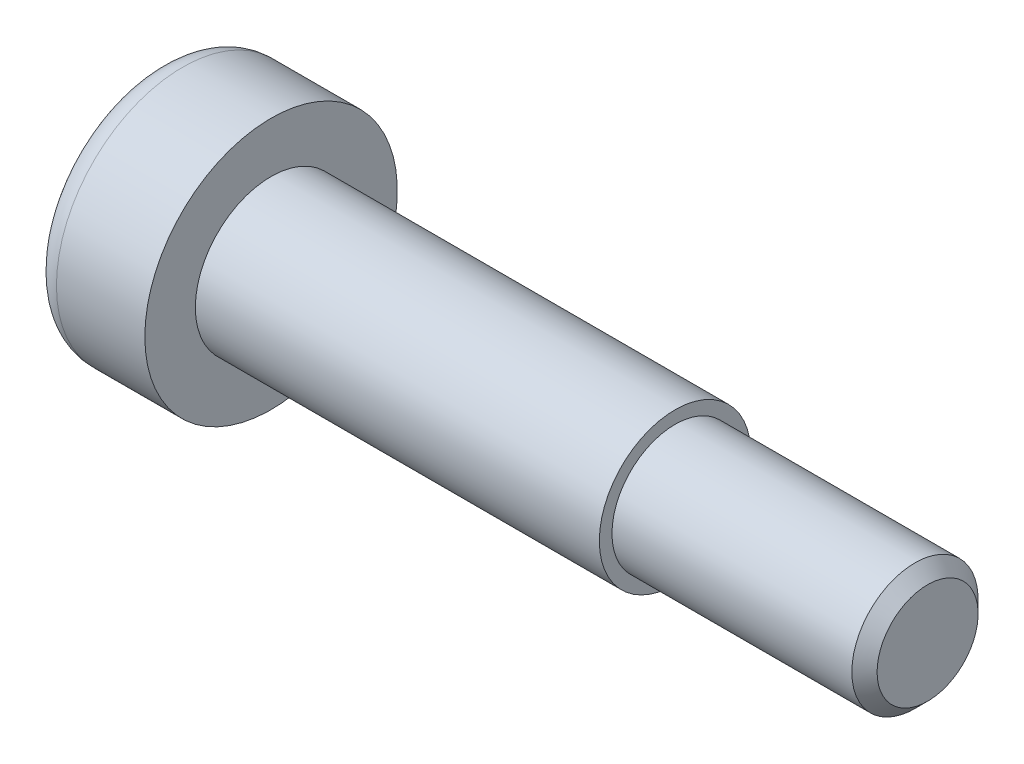
ISO-10303-21;
HEADER;
FILE_DESCRIPTION(('STEP AP214'),'2;1');
FILE_NAME('part.step','',(''),(''),'','','');
FILE_SCHEMA(('AUTOMOTIVE_DESIGN { 1 0 10303 214 1 1 1 1 }'));
ENDSEC;
DATA;
#1=APPLICATION_CONTEXT('core data for automotive mechanical design processes');
#2=APPLICATION_PROTOCOL_DEFINITION('international standard','automotive_design',2000,#1);
#3=PRODUCT_CONTEXT('',#1,'mechanical');
#4=PRODUCT('Part','Part','',(#3));
#5=PRODUCT_RELATED_PRODUCT_CATEGORY('part','',(#4));
#6=PRODUCT_DEFINITION_FORMATION('','',#4);
#7=PRODUCT_DEFINITION_CONTEXT('part definition',#1,'design');
#8=PRODUCT_DEFINITION('design','',#6,#7);
#9=PRODUCT_DEFINITION_SHAPE('','',#8);
#10=(LENGTH_UNIT() NAMED_UNIT(*) SI_UNIT(.MILLI.,.METRE.));
#11=(NAMED_UNIT(*) PLANE_ANGLE_UNIT() SI_UNIT($,.RADIAN.));
#12=(NAMED_UNIT(*) SI_UNIT($,.STERADIAN.) SOLID_ANGLE_UNIT());
#13=UNCERTAINTY_MEASURE_WITH_UNIT(LENGTH_MEASURE(1.E-05),#10,'distance_accuracy_value','');
#14=(GEOMETRIC_REPRESENTATION_CONTEXT(3) GLOBAL_UNCERTAINTY_ASSIGNED_CONTEXT((#13)) GLOBAL_UNIT_ASSIGNED_CONTEXT((#10,
#11,#12)) REPRESENTATION_CONTEXT('',''));
#15=CARTESIAN_POINT('',(0.,0.,0.));
#16=DIRECTION('',(0.,0.,1.));
#17=DIRECTION('',(1.,0.,0.));
#18=AXIS2_PLACEMENT_3D('',#15,#16,#17);
#19=CARTESIAN_POINT('',(0.,0.,0.));
#20=DIRECTION('',(1.,0.,0.));
#21=DIRECTION('',(0.,0.,-1.));
#22=AXIS2_PLACEMENT_3D('',#19,#20,#21);
#23=PLANE('',#22);
#24=CARTESIAN_POINT('',(0.,0.,0.));
#25=DIRECTION('',(1.,0.,0.));
#26=DIRECTION('',(0.,0.,-1.));
#27=AXIS2_PLACEMENT_3D('',#24,#25,#26);
#28=CIRCLE('',#27,4.);
#29=CARTESIAN_POINT('',(0.,0.,-4.));
#30=VERTEX_POINT('',#29);
#31=EDGE_CURVE('E157',#30,#30,#28,.F.);
#32=ORIENTED_EDGE('',*,*,#31,.T.);
#33=EDGE_LOOP('',(#32));
#34=FACE_BOUND('',#33,.T.);
#35=DIRECTION('',(0.,-0.5,-0.866025403784439));
#36=VECTOR('',#35,1.);
#37=CARTESIAN_POINT('',(0.,1.73205080756888,0.));
#38=LINE('',#37,#36);
#39=CARTESIAN_POINT('',(0.,1.73205080756888,0.));
#40=VERTEX_POINT('',#39);
#41=CARTESIAN_POINT('',(0.,0.866025403784439,-1.5));
#42=VERTEX_POINT('',#41);
#43=EDGE_CURVE('E127',#40,#42,#38,.T.);
#44=ORIENTED_EDGE('',*,*,#43,.F.);
#45=DIRECTION('',(0.,0.5,-0.866025403784439));
#46=VECTOR('',#45,1.);
#47=CARTESIAN_POINT('',(0.,0.86602540378444,1.5));
#48=LINE('',#47,#46);
#49=CARTESIAN_POINT('',(0.,0.86602540378444,1.5));
#50=VERTEX_POINT('',#49);
#51=EDGE_CURVE('E53',#50,#40,#48,.T.);
#52=ORIENTED_EDGE('',*,*,#51,.F.);
#53=DIRECTION('',(0.,1.,0.));
#54=VECTOR('',#53,1.);
#55=CARTESIAN_POINT('',(0.,-0.866025403784439,1.5));
#56=LINE('',#55,#54);
#57=CARTESIAN_POINT('',(0.,-0.866025403784439,1.5));
#58=VERTEX_POINT('',#57);
#59=EDGE_CURVE('E136',#58,#50,#56,.T.);
#60=ORIENTED_EDGE('',*,*,#59,.F.);
#61=DIRECTION('',(0.,0.5,0.866025403784439));
#62=VECTOR('',#61,1.);
#63=CARTESIAN_POINT('',(0.,-1.73205080756888,0.));
#64=LINE('',#63,#62);
#65=CARTESIAN_POINT('',(0.,-1.73205080756888,0.));
#66=VERTEX_POINT('',#65);
#67=EDGE_CURVE('E134',#66,#58,#64,.T.);
#68=ORIENTED_EDGE('',*,*,#67,.F.);
#69=DIRECTION('',(0.,-0.5,0.866025403784439));
#70=VECTOR('',#69,1.);
#71=CARTESIAN_POINT('',(0.,-0.866025403784439,-1.5));
#72=LINE('',#71,#70);
#73=CARTESIAN_POINT('',(0.,-0.866025403784439,-1.5));
#74=VERTEX_POINT('',#73);
#75=EDGE_CURVE('E101',#74,#66,#72,.T.);
#76=ORIENTED_EDGE('',*,*,#75,.F.);
#77=DIRECTION('',(0.,-1.,0.));
#78=VECTOR('',#77,1.);
#79=CARTESIAN_POINT('',(0.,0.866025403784439,-1.5));
#80=LINE('',#79,#78);
#81=EDGE_CURVE('E130',#42,#74,#80,.T.);
#82=ORIENTED_EDGE('',*,*,#81,.F.);
#83=EDGE_LOOP('',(#44,#52,#60,#68,#76,#82));
#84=FACE_BOUND('',#83,.T.);
#85=ADVANCED_FACE('F38',(#34,#84),#23,.F.);
#86=CARTESIAN_POINT('',(0.,0.,0.));
#87=DIRECTION('',(-1.,0.,0.));
#88=DIRECTION('',(0.,0.,1.));
#89=AXIS2_PLACEMENT_3D('',#86,#87,#88);
#90=CYLINDRICAL_SURFACE('',#89,5.);
#91=CARTESIAN_POINT('',(1.,0.,0.));
#92=DIRECTION('',(1.,0.,0.));
#93=DIRECTION('',(0.,0.,-1.));
#94=AXIS2_PLACEMENT_3D('',#91,#92,#93);
#95=CIRCLE('',#94,5.);
#96=CARTESIAN_POINT('',(1.,0.,-5.));
#97=VERTEX_POINT('',#96);
#98=EDGE_CURVE('E160',#97,#97,#95,.T.);
#99=ORIENTED_EDGE('',*,*,#98,.T.);
#100=EDGE_LOOP('',(#99));
#101=FACE_BOUND('',#100,.T.);
#102=CARTESIAN_POINT('',(4.5,0.,0.));
#103=DIRECTION('',(-1.,0.,0.));
#104=DIRECTION('',(0.,0.,1.));
#105=AXIS2_PLACEMENT_3D('',#102,#103,#104);
#106=CIRCLE('',#105,5.);
#107=CARTESIAN_POINT('',(4.5,0.,5.));
#108=VERTEX_POINT('',#107);
#109=EDGE_CURVE('E154',#108,#108,#106,.T.);
#110=ORIENTED_EDGE('',*,*,#109,.T.);
#111=EDGE_LOOP('',(#110));
#112=FACE_BOUND('',#111,.T.);
#113=ADVANCED_FACE('F177',(#101,#112),#90,.T.);
#114=CARTESIAN_POINT('',(4.5,5.,0.));
#115=DIRECTION('',(-1.,0.,0.));
#116=DIRECTION('',(0.,0.,1.));
#117=AXIS2_PLACEMENT_3D('',#114,#115,#116);
#118=PLANE('',#117);
#119=ORIENTED_EDGE('',*,*,#109,.F.);
#120=EDGE_LOOP('',(#119));
#121=FACE_BOUND('',#120,.T.);
#122=CARTESIAN_POINT('',(4.5,0.,0.));
#123=DIRECTION('',(-1.,0.,0.));
#124=DIRECTION('',(0.,0.,1.));
#125=AXIS2_PLACEMENT_3D('',#122,#123,#124);
#126=CIRCLE('',#125,3.);
#127=CARTESIAN_POINT('',(4.5,0.,3.));
#128=VERTEX_POINT('',#127);
#129=EDGE_CURVE('E151',#128,#128,#126,.T.);
#130=ORIENTED_EDGE('',*,*,#129,.T.);
#131=EDGE_LOOP('',(#130));
#132=FACE_BOUND('',#131,.T.);
#133=ADVANCED_FACE('F183',(#121,#132),#118,.F.);
#134=CARTESIAN_POINT('',(0.,0.,0.));
#135=DIRECTION('',(-1.,0.,0.));
#136=DIRECTION('',(0.,0.,1.));
#137=AXIS2_PLACEMENT_3D('',#134,#135,#136);
#138=CYLINDRICAL_SURFACE('',#137,3.);
#139=ORIENTED_EDGE('',*,*,#129,.F.);
#140=EDGE_LOOP('',(#139));
#141=FACE_BOUND('',#140,.T.);
#142=CARTESIAN_POINT('',(20.5,0.,0.));
#143=DIRECTION('',(-1.,0.,0.));
#144=DIRECTION('',(0.,0.,1.));
#145=AXIS2_PLACEMENT_3D('',#142,#143,#144);
#146=CIRCLE('',#145,3.);
#147=CARTESIAN_POINT('',(20.5,0.,3.));
#148=VERTEX_POINT('',#147);
#149=EDGE_CURVE('E148',#148,#148,#146,.T.);
#150=ORIENTED_EDGE('',*,*,#149,.T.);
#151=EDGE_LOOP('',(#150));
#152=FACE_BOUND('',#151,.T.);
#153=ADVANCED_FACE('F190',(#141,#152),#138,.T.);
#154=CARTESIAN_POINT('',(20.5,3.,0.));
#155=DIRECTION('',(-1.,0.,0.));
#156=DIRECTION('',(0.,0.,1.));
#157=AXIS2_PLACEMENT_3D('',#154,#155,#156);
#158=PLANE('',#157);
#159=ORIENTED_EDGE('',*,*,#149,.F.);
#160=EDGE_LOOP('',(#159));
#161=FACE_BOUND('',#160,.T.);
#162=CARTESIAN_POINT('',(20.5,0.,0.));
#163=DIRECTION('',(-1.,0.,0.));
#164=DIRECTION('',(0.,0.,1.));
#165=AXIS2_PLACEMENT_3D('',#162,#163,#164);
#166=CIRCLE('',#165,2.5);
#167=CARTESIAN_POINT('',(20.5,0.,2.5));
#168=VERTEX_POINT('',#167);
#169=EDGE_CURVE('E140',#168,#168,#166,.T.);
#170=ORIENTED_EDGE('',*,*,#169,.T.);
#171=EDGE_LOOP('',(#170));
#172=FACE_BOUND('',#171,.T.);
#173=ADVANCED_FACE('F194',(#161,#172),#158,.F.);
#174=CARTESIAN_POINT('',(0.,0.,0.));
#175=DIRECTION('',(-1.,0.,0.));
#176=DIRECTION('',(0.,0.,1.));
#177=AXIS2_PLACEMENT_3D('',#174,#175,#176);
#178=CYLINDRICAL_SURFACE('',#177,2.5);
#179=CARTESIAN_POINT('',(30.,0.,0.));
#180=DIRECTION('',(-1.,0.,0.));
#181=DIRECTION('',(0.,0.,1.));
#182=AXIS2_PLACEMENT_3D('',#179,#180,#181);
#183=CIRCLE('',#182,2.5);
#184=CARTESIAN_POINT('',(30.,0.,2.5));
#185=VERTEX_POINT('',#184);
#186=EDGE_CURVE('E46',#185,#185,#183,.T.);
#187=ORIENTED_EDGE('',*,*,#186,.T.);
#188=EDGE_LOOP('',(#187));
#189=FACE_BOUND('',#188,.T.);
#190=ORIENTED_EDGE('',*,*,#169,.F.);
#191=EDGE_LOOP('',(#190));
#192=FACE_BOUND('',#191,.T.);
#193=ADVANCED_FACE('F165',(#189,#192),#178,.T.);
#194=CARTESIAN_POINT('',(30.5,2.5,0.));
#195=DIRECTION('',(-1.,0.,0.));
#196=DIRECTION('',(0.,0.,1.));
#197=AXIS2_PLACEMENT_3D('',#194,#195,#196);
#198=PLANE('',#197);
#199=CARTESIAN_POINT('',(30.5,0.,0.));
#200=DIRECTION('',(-1.,0.,0.));
#201=DIRECTION('',(0.,0.,1.));
#202=AXIS2_PLACEMENT_3D('',#199,#200,#201);
#203=CIRCLE('',#202,1.99999999999999);
#204=CARTESIAN_POINT('',(30.5,0.,1.99999999999999));
#205=VERTEX_POINT('',#204);
#206=EDGE_CURVE('E11',#205,#205,#203,.F.);
#207=ORIENTED_EDGE('',*,*,#206,.T.);
#208=EDGE_LOOP('',(#207));
#209=FACE_BOUND('',#208,.T.);
#210=ADVANCED_FACE('F201',(#209),#198,.F.);
#211=CARTESIAN_POINT('',(3.,0.86602540378444,1.5));
#212=DIRECTION('',(0.,0.866025403784439,0.5));
#213=DIRECTION('',(0.,-0.5,0.866025403784439));
#214=AXIS2_PLACEMENT_3D('',#211,#212,#213);
#215=PLANE('',#214);
#216=ORIENTED_EDGE('',*,*,#51,.T.);
#217=DIRECTION('',(-1.,0.,0.));
#218=VECTOR('',#217,1.);
#219=CARTESIAN_POINT('',(3.,1.73205080756888,0.));
#220=LINE('',#219,#218);
#221=CARTESIAN_POINT('',(3.,1.73205080756888,0.));
#222=VERTEX_POINT('',#221);
#223=EDGE_CURVE('E83',#222,#40,#220,.T.);
#224=ORIENTED_EDGE('',*,*,#223,.F.);
#225=DIRECTION('',(0.,0.5,-0.866025403784439));
#226=VECTOR('',#225,1.);
#227=CARTESIAN_POINT('',(3.,0.86602540378444,1.5));
#228=LINE('',#227,#226);
#229=CARTESIAN_POINT('',(3.,0.86602540378444,1.5));
#230=VERTEX_POINT('',#229);
#231=EDGE_CURVE('E138',#230,#222,#228,.T.);
#232=ORIENTED_EDGE('',*,*,#231,.F.);
#233=DIRECTION('',(-1.,0.,0.));
#234=VECTOR('',#233,1.);
#235=CARTESIAN_POINT('',(3.,0.86602540378444,1.5));
#236=LINE('',#235,#234);
#237=EDGE_CURVE('E61',#230,#50,#236,.T.);
#238=ORIENTED_EDGE('',*,*,#237,.T.);
#239=EDGE_LOOP('',(#216,#224,#232,#238));
#240=FACE_BOUND('',#239,.T.);
#241=ADVANCED_FACE('F204',(#240),#215,.F.);
#242=CARTESIAN_POINT('',(3.,-0.866025403784439,1.5));
#243=DIRECTION('',(0.,0.,1.));
#244=DIRECTION('',(1.,0.,0.));
#245=AXIS2_PLACEMENT_3D('',#242,#243,#244);
#246=PLANE('',#245);
#247=ORIENTED_EDGE('',*,*,#59,.T.);
#248=ORIENTED_EDGE('',*,*,#237,.F.);
#249=DIRECTION('',(0.,1.,0.));
#250=VECTOR('',#249,1.);
#251=CARTESIAN_POINT('',(3.,-0.866025403784439,1.5));
#252=LINE('',#251,#250);
#253=CARTESIAN_POINT('',(3.,-0.866025403784439,1.5));
#254=VERTEX_POINT('',#253);
#255=EDGE_CURVE('E113',#254,#230,#252,.T.);
#256=ORIENTED_EDGE('',*,*,#255,.F.);
#257=DIRECTION('',(-1.,0.,0.));
#258=VECTOR('',#257,1.);
#259=CARTESIAN_POINT('',(3.,-0.866025403784439,1.5));
#260=LINE('',#259,#258);
#261=EDGE_CURVE('E105',#254,#58,#260,.T.);
#262=ORIENTED_EDGE('',*,*,#261,.T.);
#263=EDGE_LOOP('',(#247,#248,#256,#262));
#264=FACE_BOUND('',#263,.T.);
#265=ADVANCED_FACE('F208',(#264),#246,.F.);
#266=CARTESIAN_POINT('',(3.,-1.73205080756888,0.));
#267=DIRECTION('',(0.,-0.866025403784439,0.5));
#268=DIRECTION('',(0.,-0.5,-0.866025403784439));
#269=AXIS2_PLACEMENT_3D('',#266,#267,#268);
#270=PLANE('',#269);
#271=ORIENTED_EDGE('',*,*,#67,.T.);
#272=ORIENTED_EDGE('',*,*,#261,.F.);
#273=DIRECTION('',(0.,0.5,0.866025403784439));
#274=VECTOR('',#273,1.);
#275=CARTESIAN_POINT('',(3.,-1.73205080756888,0.));
#276=LINE('',#275,#274);
#277=CARTESIAN_POINT('',(3.,-1.73205080756888,0.));
#278=VERTEX_POINT('',#277);
#279=EDGE_CURVE('E109',#278,#254,#276,.T.);
#280=ORIENTED_EDGE('',*,*,#279,.F.);
#281=DIRECTION('',(-1.,0.,0.));
#282=VECTOR('',#281,1.);
#283=CARTESIAN_POINT('',(3.,-1.73205080756888,0.));
#284=LINE('',#283,#282);
#285=EDGE_CURVE('E94',#278,#66,#284,.T.);
#286=ORIENTED_EDGE('',*,*,#285,.T.);
#287=EDGE_LOOP('',(#271,#272,#280,#286));
#288=FACE_BOUND('',#287,.T.);
#289=ADVANCED_FACE('F110',(#288),#270,.F.);
#290=CARTESIAN_POINT('',(3.,-0.866025403784439,-1.5));
#291=DIRECTION('',(0.,-0.866025403784438,-0.5));
#292=DIRECTION('',(0.,0.5,-0.866025403784439));
#293=AXIS2_PLACEMENT_3D('',#290,#291,#292);
#294=PLANE('',#293);
#295=ORIENTED_EDGE('',*,*,#75,.T.);
#296=ORIENTED_EDGE('',*,*,#285,.F.);
#297=DIRECTION('',(0.,-0.5,0.866025403784439));
#298=VECTOR('',#297,1.);
#299=CARTESIAN_POINT('',(3.,-0.866025403784439,-1.5));
#300=LINE('',#299,#298);
#301=CARTESIAN_POINT('',(3.,-0.866025403784439,-1.5));
#302=VERTEX_POINT('',#301);
#303=EDGE_CURVE('E98',#302,#278,#300,.T.);
#304=ORIENTED_EDGE('',*,*,#303,.F.);
#305=DIRECTION('',(-1.,0.,0.));
#306=VECTOR('',#305,1.);
#307=CARTESIAN_POINT('',(3.,-0.866025403784439,-1.5));
#308=LINE('',#307,#306);
#309=EDGE_CURVE('E106',#302,#74,#308,.T.);
#310=ORIENTED_EDGE('',*,*,#309,.T.);
#311=EDGE_LOOP('',(#295,#296,#304,#310));
#312=FACE_BOUND('',#311,.T.);
#313=ADVANCED_FACE('F96',(#312),#294,.F.);
#314=CARTESIAN_POINT('',(3.,0.866025403784439,-1.5));
#315=DIRECTION('',(0.,0.,-1.));
#316=DIRECTION('',(-1.,0.,0.));
#317=AXIS2_PLACEMENT_3D('',#314,#315,#316);
#318=PLANE('',#317);
#319=ORIENTED_EDGE('',*,*,#81,.T.);
#320=ORIENTED_EDGE('',*,*,#309,.F.);
#321=DIRECTION('',(0.,-1.,0.));
#322=VECTOR('',#321,1.);
#323=CARTESIAN_POINT('',(3.,0.866025403784439,-1.5));
#324=LINE('',#323,#322);
#325=CARTESIAN_POINT('',(3.,0.866025403784439,-1.5));
#326=VERTEX_POINT('',#325);
#327=EDGE_CURVE('E119',#326,#302,#324,.T.);
#328=ORIENTED_EDGE('',*,*,#327,.F.);
#329=DIRECTION('',(-1.,0.,0.));
#330=VECTOR('',#329,1.);
#331=CARTESIAN_POINT('',(3.,0.866025403784439,-1.5));
#332=LINE('',#331,#330);
#333=EDGE_CURVE('E143',#326,#42,#332,.T.);
#334=ORIENTED_EDGE('',*,*,#333,.T.);
#335=EDGE_LOOP('',(#319,#320,#328,#334));
#336=FACE_BOUND('',#335,.T.);
#337=ADVANCED_FACE('F212',(#336),#318,.F.);
#338=CARTESIAN_POINT('',(3.,1.73205080756888,0.));
#339=DIRECTION('',(0.,0.866025403784439,-0.5));
#340=DIRECTION('',(0.,0.5,0.866025403784439));
#341=AXIS2_PLACEMENT_3D('',#338,#339,#340);
#342=PLANE('',#341);
#343=ORIENTED_EDGE('',*,*,#43,.T.);
#344=ORIENTED_EDGE('',*,*,#333,.F.);
#345=DIRECTION('',(0.,-0.5,-0.866025403784439));
#346=VECTOR('',#345,1.);
#347=CARTESIAN_POINT('',(3.,1.73205080756888,0.));
#348=LINE('',#347,#346);
#349=EDGE_CURVE('E121',#222,#326,#348,.T.);
#350=ORIENTED_EDGE('',*,*,#349,.F.);
#351=ORIENTED_EDGE('',*,*,#223,.T.);
#352=EDGE_LOOP('',(#343,#344,#350,#351));
#353=FACE_BOUND('',#352,.T.);
#354=ADVANCED_FACE('F209',(#353),#342,.F.);
#355=CARTESIAN_POINT('',(3.,0.,0.));
#356=DIRECTION('',(-1.,0.,0.));
#357=DIRECTION('',(0.,0.,1.));
#358=AXIS2_PLACEMENT_3D('',#355,#356,#357);
#359=PLANE('',#358);
#360=ORIENTED_EDGE('',*,*,#231,.T.);
#361=ORIENTED_EDGE('',*,*,#349,.T.);
#362=ORIENTED_EDGE('',*,*,#327,.T.);
#363=ORIENTED_EDGE('',*,*,#303,.T.);
#364=ORIENTED_EDGE('',*,*,#279,.T.);
#365=ORIENTED_EDGE('',*,*,#255,.T.);
#366=EDGE_LOOP('',(#360,#361,#362,#363,#364,#365));
#367=FACE_BOUND('',#366,.T.);
#368=ADVANCED_FACE('F116',(#367),#359,.T.);
#369=CARTESIAN_POINT('',(1.,0.,0.));
#370=DIRECTION('',(1.,0.,0.));
#371=DIRECTION('',(0.,0.,-1.));
#372=AXIS2_PLACEMENT_3D('',#369,#370,#371);
#373=TOROIDAL_SURFACE('',#372,4.,1.);
#374=ORIENTED_EDGE('',*,*,#98,.F.);
#375=EDGE_LOOP('',(#374));
#376=FACE_BOUND('',#375,.T.);
#377=ORIENTED_EDGE('',*,*,#31,.F.);
#378=EDGE_LOOP('',(#377));
#379=FACE_BOUND('',#378,.T.);
#380=ADVANCED_FACE('F169',(#376,#379),#373,.T.);
#381=CARTESIAN_POINT('',(30.,0.,0.));
#382=DIRECTION('',(-1.,0.,0.));
#383=DIRECTION('',(0.,0.,1.));
#384=AXIS2_PLACEMENT_3D('',#381,#382,#383);
#385=CONICAL_SURFACE('',#384,2.5,0.785398163397454);
#386=ORIENTED_EDGE('',*,*,#206,.F.);
#387=EDGE_LOOP('',(#386));
#388=FACE_BOUND('',#387,.T.);
#389=ORIENTED_EDGE('',*,*,#186,.F.);
#390=EDGE_LOOP('',(#389));
#391=FACE_BOUND('',#390,.T.);
#392=ADVANCED_FACE('F40',(#388,#391),#385,.T.);
#393=CLOSED_SHELL('',(#85,#113,#133,#153,#173,#193,#210,#241,#265,#289,#313,#337,#354,#368,#380,#392));
#394=MANIFOLD_SOLID_BREP('B2',#393);
#395=ADVANCED_BREP_SHAPE_REPRESENTATION('',(#18,#394),#14);
#396=SHAPE_DEFINITION_REPRESENTATION(#9,#395);
ENDSEC;
END-ISO-10303-21;
